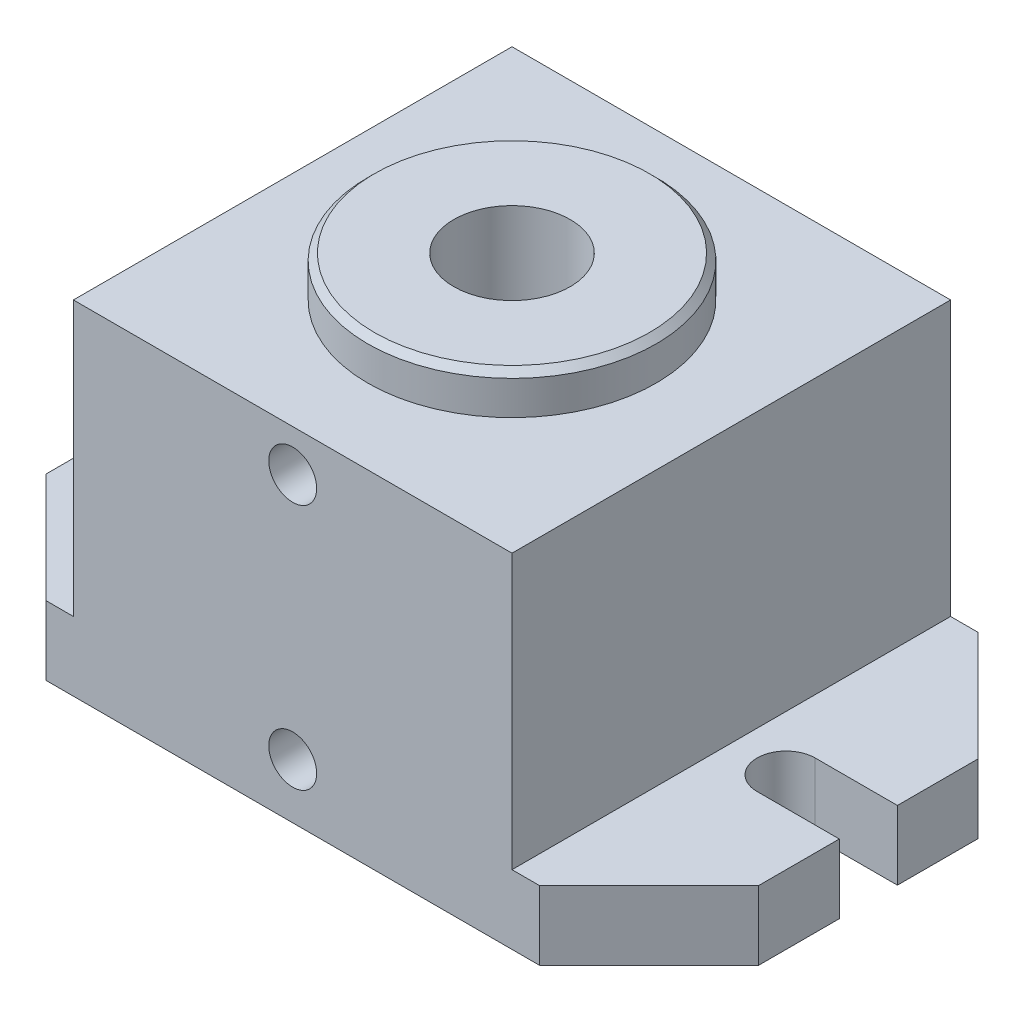
ISO-10303-21;
HEADER;
FILE_DESCRIPTION(('STEP AP214'),'2;1');
FILE_NAME('part.step','',(''),(''),'','','');
FILE_SCHEMA(('AUTOMOTIVE_DESIGN { 1 0 10303 214 1 1 1 1 }'));
ENDSEC;
DATA;
#1=APPLICATION_CONTEXT('core data for automotive mechanical design processes');
#2=APPLICATION_PROTOCOL_DEFINITION('international standard','automotive_design',2000,#1);
#3=PRODUCT_CONTEXT('',#1,'mechanical');
#4=PRODUCT('Part','Part','',(#3));
#5=PRODUCT_RELATED_PRODUCT_CATEGORY('part','',(#4));
#6=PRODUCT_DEFINITION_FORMATION('','',#4);
#7=PRODUCT_DEFINITION_CONTEXT('part definition',#1,'design');
#8=PRODUCT_DEFINITION('design','',#6,#7);
#9=PRODUCT_DEFINITION_SHAPE('','',#8);
#10=(LENGTH_UNIT() NAMED_UNIT(*) SI_UNIT(.MILLI.,.METRE.));
#11=(NAMED_UNIT(*) PLANE_ANGLE_UNIT() SI_UNIT($,.RADIAN.));
#12=(NAMED_UNIT(*) SI_UNIT($,.STERADIAN.) SOLID_ANGLE_UNIT());
#13=UNCERTAINTY_MEASURE_WITH_UNIT(LENGTH_MEASURE(1.E-05),#10,'distance_accuracy_value','');
#14=(GEOMETRIC_REPRESENTATION_CONTEXT(3) GLOBAL_UNCERTAINTY_ASSIGNED_CONTEXT((#13)) GLOBAL_UNIT_ASSIGNED_CONTEXT((#10,
#11,#12)) REPRESENTATION_CONTEXT('',''));
#15=CARTESIAN_POINT('',(0.,0.,0.));
#16=DIRECTION('',(0.,0.,1.));
#17=DIRECTION('',(1.,0.,0.));
#18=AXIS2_PLACEMENT_3D('',#15,#16,#17);
#19=CARTESIAN_POINT('',(-50.8,79.502,50.8));
#20=DIRECTION('',(0.,1.,0.));
#21=DIRECTION('',(0.,0.,1.));
#22=AXIS2_PLACEMENT_3D('',#19,#20,#21);
#23=PLANE('',#22);
#24=DIRECTION('',(0.,0.,1.));
#25=VECTOR('',#24,1.);
#26=CARTESIAN_POINT('',(-50.8,79.502,-50.8));
#27=LINE('',#26,#25);
#28=CARTESIAN_POINT('',(-50.8,79.502,-50.8));
#29=VERTEX_POINT('',#28);
#30=CARTESIAN_POINT('',(-50.8,79.502,50.8));
#31=VERTEX_POINT('',#30);
#32=EDGE_CURVE('E281',#29,#31,#27,.T.);
#33=ORIENTED_EDGE('',*,*,#32,.T.);
#34=DIRECTION('',(1.,0.,0.));
#35=VECTOR('',#34,1.);
#36=CARTESIAN_POINT('',(-50.8,79.502,50.8));
#37=LINE('',#36,#35);
#38=CARTESIAN_POINT('',(50.8,79.502,50.8));
#39=VERTEX_POINT('',#38);
#40=EDGE_CURVE('E289',#31,#39,#37,.T.);
#41=ORIENTED_EDGE('',*,*,#40,.T.);
#42=DIRECTION('',(0.,0.,-1.));
#43=VECTOR('',#42,1.);
#44=CARTESIAN_POINT('',(50.8,79.502,50.8));
#45=LINE('',#44,#43);
#46=CARTESIAN_POINT('',(50.8,79.502,-50.8));
#47=VERTEX_POINT('',#46);
#48=EDGE_CURVE('E287',#39,#47,#45,.T.);
#49=ORIENTED_EDGE('',*,*,#48,.T.);
#50=DIRECTION('',(-1.,0.,0.));
#51=VECTOR('',#50,1.);
#52=CARTESIAN_POINT('',(50.8,79.502,-50.8));
#53=LINE('',#52,#51);
#54=EDGE_CURVE('E285',#47,#29,#53,.T.);
#55=ORIENTED_EDGE('',*,*,#54,.T.);
#56=EDGE_LOOP('',(#33,#41,#49,#55));
#57=FACE_BOUND('',#56,.T.);
#58=CARTESIAN_POINT('',(0.,79.502,0.));
#59=DIRECTION('',(0.,1.,0.));
#60=DIRECTION('',(0.,0.,1.));
#61=AXIS2_PLACEMENT_3D('',#58,#59,#60);
#62=CIRCLE('',#61,33.401);
#63=CARTESIAN_POINT('',(0.,79.502,33.401));
#64=VERTEX_POINT('',#63);
#65=EDGE_CURVE('E284',#64,#64,#62,.T.);
#66=ORIENTED_EDGE('',*,*,#65,.F.);
#67=EDGE_LOOP('',(#66));
#68=FACE_BOUND('',#67,.T.);
#69=ADVANCED_FACE('F35',(#57,#68),#23,.T.);
#70=CARTESIAN_POINT('',(-50.8,79.502,-50.8));
#71=DIRECTION('',(1.,0.,0.));
#72=DIRECTION('',(0.,0.,-1.));
#73=AXIS2_PLACEMENT_3D('',#70,#71,#72);
#74=PLANE('',#73);
#75=DIRECTION('',(0.,-1.,0.));
#76=VECTOR('',#75,1.);
#77=CARTESIAN_POINT('',(-50.8,79.502,-50.8));
#78=LINE('',#77,#76);
#79=CARTESIAN_POINT('',(-50.8,16.002,-50.8));
#80=VERTEX_POINT('',#79);
#81=EDGE_CURVE('E219',#29,#80,#78,.T.);
#82=ORIENTED_EDGE('',*,*,#81,.T.);
#83=DIRECTION('',(0.,0.,1.));
#84=VECTOR('',#83,1.);
#85=CARTESIAN_POINT('',(-50.8,16.002,50.8));
#86=LINE('',#85,#84);
#87=CARTESIAN_POINT('',(-50.8,16.002,50.8));
#88=VERTEX_POINT('',#87);
#89=EDGE_CURVE('E214',#80,#88,#86,.T.);
#90=ORIENTED_EDGE('',*,*,#89,.T.);
#91=DIRECTION('',(0.,-1.,0.));
#92=VECTOR('',#91,1.);
#93=CARTESIAN_POINT('',(-50.8,79.502,50.8));
#94=LINE('',#93,#92);
#95=EDGE_CURVE('E256',#31,#88,#94,.T.);
#96=ORIENTED_EDGE('',*,*,#95,.F.);
#97=ORIENTED_EDGE('',*,*,#32,.F.);
#98=EDGE_LOOP('',(#82,#90,#96,#97));
#99=FACE_BOUND('',#98,.T.);
#100=ADVANCED_FACE('F432',(#99),#74,.F.);
#101=CARTESIAN_POINT('',(-50.8,79.502,50.8));
#102=DIRECTION('',(0.,0.,-1.));
#103=DIRECTION('',(-1.,0.,0.));
#104=AXIS2_PLACEMENT_3D('',#101,#102,#103);
#105=PLANE('',#104);
#106=CARTESIAN_POINT('',(0.,12.7,50.8));
#107=DIRECTION('',(0.,0.,1.));
#108=DIRECTION('',(1.,0.,0.));
#109=AXIS2_PLACEMENT_3D('',#106,#107,#108);
#110=CIRCLE('',#109,5.5499);
#111=CARTESIAN_POINT('',(5.5499,12.7,50.8));
#112=VERTEX_POINT('',#111);
#113=EDGE_CURVE('E750',#112,#112,#110,.T.);
#114=ORIENTED_EDGE('',*,*,#113,.F.);
#115=EDGE_LOOP('',(#114));
#116=FACE_BOUND('',#115,.T.);
#117=CARTESIAN_POINT('',(0.,69.85,50.8));
#118=DIRECTION('',(0.,0.,1.));
#119=DIRECTION('',(1.,0.,0.));
#120=AXIS2_PLACEMENT_3D('',#117,#118,#119);
#121=CIRCLE('',#120,5.5499);
#122=CARTESIAN_POINT('',(5.5499,69.85,50.8));
#123=VERTEX_POINT('',#122);
#124=EDGE_CURVE('E204',#123,#123,#121,.T.);
#125=ORIENTED_EDGE('',*,*,#124,.F.);
#126=EDGE_LOOP('',(#125));
#127=FACE_BOUND('',#126,.T.);
#128=DIRECTION('',(1.,0.,0.));
#129=VECTOR('',#128,1.);
#130=CARTESIAN_POINT('',(-50.8,0.,50.8));
#131=LINE('',#130,#129);
#132=CARTESIAN_POINT('',(-57.1499999999999,0.,50.8));
#133=VERTEX_POINT('',#132);
#134=CARTESIAN_POINT('',(57.1499999999999,0.,50.8));
#135=VERTEX_POINT('',#134);
#136=EDGE_CURVE('E282',#133,#135,#131,.T.);
#137=ORIENTED_EDGE('',*,*,#136,.T.);
#138=DIRECTION('',(0.,1.,0.));
#139=VECTOR('',#138,1.);
#140=CARTESIAN_POINT('',(57.1499999999999,16.002,50.8));
#141=LINE('',#140,#139);
#142=CARTESIAN_POINT('',(57.1499999999999,16.002,50.8));
#143=VERTEX_POINT('',#142);
#144=EDGE_CURVE('E43',#135,#143,#141,.T.);
#145=ORIENTED_EDGE('',*,*,#144,.T.);
#146=DIRECTION('',(-1.,0.,0.));
#147=VECTOR('',#146,1.);
#148=CARTESIAN_POINT('',(50.8,16.002,50.8));
#149=LINE('',#148,#147);
#150=CARTESIAN_POINT('',(50.8,16.002,50.8));
#151=VERTEX_POINT('',#150);
#152=EDGE_CURVE('E246',#143,#151,#149,.T.);
#153=ORIENTED_EDGE('',*,*,#152,.T.);
#154=DIRECTION('',(0.,-1.,0.));
#155=VECTOR('',#154,1.);
#156=CARTESIAN_POINT('',(50.8,79.502,50.8));
#157=LINE('',#156,#155);
#158=EDGE_CURVE('E260',#39,#151,#157,.T.);
#159=ORIENTED_EDGE('',*,*,#158,.F.);
#160=ORIENTED_EDGE('',*,*,#40,.F.);
#161=ORIENTED_EDGE('',*,*,#95,.T.);
#162=DIRECTION('',(-1.,0.,0.));
#163=VECTOR('',#162,1.);
#164=CARTESIAN_POINT('',(-50.8,16.002,50.8));
#165=LINE('',#164,#163);
#166=CARTESIAN_POINT('',(-57.1499999999999,16.002,50.8));
#167=VERTEX_POINT('',#166);
#168=EDGE_CURVE('E218',#88,#167,#165,.T.);
#169=ORIENTED_EDGE('',*,*,#168,.T.);
#170=DIRECTION('',(0.,-1.,0.));
#171=VECTOR('',#170,1.);
#172=CARTESIAN_POINT('',(-57.1499999999999,0.,50.8));
#173=LINE('',#172,#171);
#174=EDGE_CURVE('E394',#167,#133,#173,.T.);
#175=ORIENTED_EDGE('',*,*,#174,.T.);
#176=EDGE_LOOP('',(#137,#145,#153,#159,#160,#161,#169,#175));
#177=FACE_BOUND('',#176,.T.);
#178=ADVANCED_FACE('F421',(#116,#127,#177),#105,.F.);
#179=CARTESIAN_POINT('',(50.8,79.502,50.8));
#180=DIRECTION('',(-1.,0.,0.));
#181=DIRECTION('',(0.,0.,1.));
#182=AXIS2_PLACEMENT_3D('',#179,#180,#181);
#183=PLANE('',#182);
#184=ORIENTED_EDGE('',*,*,#158,.T.);
#185=DIRECTION('',(0.,0.,-1.));
#186=VECTOR('',#185,1.);
#187=CARTESIAN_POINT('',(50.8,16.002,50.8));
#188=LINE('',#187,#186);
#189=CARTESIAN_POINT('',(50.8,16.002,-50.8));
#190=VERTEX_POINT('',#189);
#191=EDGE_CURVE('E312',#151,#190,#188,.T.);
#192=ORIENTED_EDGE('',*,*,#191,.T.);
#193=DIRECTION('',(0.,-1.,0.));
#194=VECTOR('',#193,1.);
#195=CARTESIAN_POINT('',(50.8,79.502,-50.8));
#196=LINE('',#195,#194);
#197=EDGE_CURVE('E271',#47,#190,#196,.T.);
#198=ORIENTED_EDGE('',*,*,#197,.F.);
#199=ORIENTED_EDGE('',*,*,#48,.F.);
#200=EDGE_LOOP('',(#184,#192,#198,#199));
#201=FACE_BOUND('',#200,.T.);
#202=ADVANCED_FACE('F450',(#201),#183,.F.);
#203=CARTESIAN_POINT('',(50.8,79.502,-50.8));
#204=DIRECTION('',(0.,0.,1.));
#205=DIRECTION('',(1.,0.,0.));
#206=AXIS2_PLACEMENT_3D('',#203,#204,#205);
#207=PLANE('',#206);
#208=DIRECTION('',(-1.,0.,0.));
#209=VECTOR('',#208,1.);
#210=CARTESIAN_POINT('',(50.8,0.,-50.8));
#211=LINE('',#210,#209);
#212=CARTESIAN_POINT('',(57.1499999999999,0.,-50.8));
#213=VERTEX_POINT('',#212);
#214=CARTESIAN_POINT('',(-57.1499999999999,0.,-50.8));
#215=VERTEX_POINT('',#214);
#216=EDGE_CURVE('E278',#213,#215,#211,.T.);
#217=ORIENTED_EDGE('',*,*,#216,.T.);
#218=DIRECTION('',(0.,1.,0.));
#219=VECTOR('',#218,1.);
#220=CARTESIAN_POINT('',(-57.1499999999999,16.002,-50.8));
#221=LINE('',#220,#219);
#222=CARTESIAN_POINT('',(-57.1499999999999,16.002,-50.8));
#223=VERTEX_POINT('',#222);
#224=EDGE_CURVE('E238',#215,#223,#221,.T.);
#225=ORIENTED_EDGE('',*,*,#224,.T.);
#226=DIRECTION('',(1.,0.,0.));
#227=VECTOR('',#226,1.);
#228=CARTESIAN_POINT('',(-50.8,16.002,-50.8));
#229=LINE('',#228,#227);
#230=EDGE_CURVE('E208',#223,#80,#229,.T.);
#231=ORIENTED_EDGE('',*,*,#230,.T.);
#232=ORIENTED_EDGE('',*,*,#81,.F.);
#233=ORIENTED_EDGE('',*,*,#54,.F.);
#234=ORIENTED_EDGE('',*,*,#197,.T.);
#235=DIRECTION('',(1.,0.,0.));
#236=VECTOR('',#235,1.);
#237=CARTESIAN_POINT('',(50.8,16.002,-50.8));
#238=LINE('',#237,#236);
#239=CARTESIAN_POINT('',(57.1499999999999,16.002,-50.8));
#240=VERTEX_POINT('',#239);
#241=EDGE_CURVE('E336',#190,#240,#238,.T.);
#242=ORIENTED_EDGE('',*,*,#241,.T.);
#243=DIRECTION('',(0.,-1.,0.));
#244=VECTOR('',#243,1.);
#245=CARTESIAN_POINT('',(57.1499999999999,0.,-50.8));
#246=LINE('',#245,#244);
#247=EDGE_CURVE('E235',#240,#213,#246,.T.);
#248=ORIENTED_EDGE('',*,*,#247,.T.);
#249=EDGE_LOOP('',(#217,#225,#231,#232,#233,#234,#242,#248));
#250=FACE_BOUND('',#249,.T.);
#251=ADVANCED_FACE('F343',(#250),#207,.F.);
#252=CARTESIAN_POINT('',(-50.8,0.,50.8));
#253=DIRECTION('',(0.,1.,0.));
#254=DIRECTION('',(0.,0.,1.));
#255=AXIS2_PLACEMENT_3D('',#252,#253,#254);
#256=PLANE('',#255);
#257=CARTESIAN_POINT('',(0.,0.,0.));
#258=DIRECTION('',(0.,1.,0.));
#259=DIRECTION('',(0.,0.,1.));
#260=AXIS2_PLACEMENT_3D('',#257,#258,#259);
#261=CIRCLE('',#260,13.4874);
#262=CARTESIAN_POINT('',(0.,0.,13.4874));
#263=VERTEX_POINT('',#262);
#264=EDGE_CURVE('E295',#263,#263,#261,.T.);
#265=ORIENTED_EDGE('',*,*,#264,.T.);
#266=EDGE_LOOP('',(#265));
#267=FACE_BOUND('',#266,.T.);
#268=DIRECTION('',(0.,0.,-1.));
#269=VECTOR('',#268,1.);
#270=CARTESIAN_POINT('',(-82.55,0.,-6.73099999999998));
#271=LINE('',#270,#269);
#272=CARTESIAN_POINT('',(-82.55,0.,-6.73099999999998));
#273=VERTEX_POINT('',#272);
#274=CARTESIAN_POINT('',(-82.55,0.,-25.3999999999999));
#275=VERTEX_POINT('',#274);
#276=EDGE_CURVE('E367',#273,#275,#271,.T.);
#277=ORIENTED_EDGE('',*,*,#276,.T.);
#278=DIRECTION('',(0.707106781186548,0.,-0.707106781186548));
#279=VECTOR('',#278,1.);
#280=CARTESIAN_POINT('',(-82.55,0.,-25.3999999999999));
#281=LINE('',#280,#279);
#282=EDGE_CURVE('E233',#275,#215,#281,.T.);
#283=ORIENTED_EDGE('',*,*,#282,.T.);
#284=ORIENTED_EDGE('',*,*,#216,.F.);
#285=DIRECTION('',(0.707106781186548,0.,0.707106781186548));
#286=VECTOR('',#285,1.);
#287=CARTESIAN_POINT('',(57.1499999999999,0.,-50.8));
#288=LINE('',#287,#286);
#289=CARTESIAN_POINT('',(82.55,0.,-25.3999999999999));
#290=VERTEX_POINT('',#289);
#291=EDGE_CURVE('E353',#213,#290,#288,.T.);
#292=ORIENTED_EDGE('',*,*,#291,.T.);
#293=DIRECTION('',(0.,0.,1.));
#294=VECTOR('',#293,1.);
#295=CARTESIAN_POINT('',(82.55,0.,-6.731));
#296=LINE('',#295,#294);
#297=CARTESIAN_POINT('',(82.55,0.,-6.731));
#298=VERTEX_POINT('',#297);
#299=EDGE_CURVE('E322',#290,#298,#296,.T.);
#300=ORIENTED_EDGE('',*,*,#299,.T.);
#301=DIRECTION('',(-1.,0.,0.));
#302=VECTOR('',#301,1.);
#303=CARTESIAN_POINT('',(63.5,0.,-6.731));
#304=LINE('',#303,#302);
#305=CARTESIAN_POINT('',(63.5,0.,-6.731));
#306=VERTEX_POINT('',#305);
#307=EDGE_CURVE('E319',#298,#306,#304,.T.);
#308=ORIENTED_EDGE('',*,*,#307,.T.);
#309=CARTESIAN_POINT('',(63.5,0.,0.));
#310=DIRECTION('',(0.,1.,0.));
#311=DIRECTION('',(0.,0.,-1.));
#312=AXIS2_PLACEMENT_3D('',#309,#310,#311);
#313=CIRCLE('',#312,6.731);
#314=CARTESIAN_POINT('',(63.5,0.,6.731));
#315=VERTEX_POINT('',#314);
#316=EDGE_CURVE('E316',#306,#315,#313,.T.);
#317=ORIENTED_EDGE('',*,*,#316,.T.);
#318=DIRECTION('',(1.,0.,0.));
#319=VECTOR('',#318,1.);
#320=CARTESIAN_POINT('',(63.5,0.,6.731));
#321=LINE('',#320,#319);
#322=CARTESIAN_POINT('',(82.55,0.,6.731));
#323=VERTEX_POINT('',#322);
#324=EDGE_CURVE('E313',#315,#323,#321,.T.);
#325=ORIENTED_EDGE('',*,*,#324,.T.);
#326=DIRECTION('',(0.,0.,1.));
#327=VECTOR('',#326,1.);
#328=CARTESIAN_POINT('',(82.55,0.,50.8));
#329=LINE('',#328,#327);
#330=CARTESIAN_POINT('',(82.55,0.,25.3999999999999));
#331=VERTEX_POINT('',#330);
#332=EDGE_CURVE('E309',#323,#331,#329,.T.);
#333=ORIENTED_EDGE('',*,*,#332,.T.);
#334=DIRECTION('',(-0.707106781186548,0.,0.707106781186548));
#335=VECTOR('',#334,1.);
#336=CARTESIAN_POINT('',(82.55,0.,25.3999999999999));
#337=LINE('',#336,#335);
#338=EDGE_CURVE('E356',#331,#135,#337,.T.);
#339=ORIENTED_EDGE('',*,*,#338,.T.);
#340=ORIENTED_EDGE('',*,*,#136,.F.);
#341=DIRECTION('',(-0.707106781186548,0.,-0.707106781186547));
#342=VECTOR('',#341,1.);
#343=CARTESIAN_POINT('',(-57.1499999999999,0.,50.8));
#344=LINE('',#343,#342);
#345=CARTESIAN_POINT('',(-82.55,0.,25.3999999999999));
#346=VERTEX_POINT('',#345);
#347=EDGE_CURVE('E357',#133,#346,#344,.T.);
#348=ORIENTED_EDGE('',*,*,#347,.T.);
#349=DIRECTION('',(0.,0.,-1.));
#350=VECTOR('',#349,1.);
#351=CARTESIAN_POINT('',(-82.55,0.,50.8));
#352=LINE('',#351,#350);
#353=CARTESIAN_POINT('',(-82.55,0.,6.73099999999998));
#354=VERTEX_POINT('',#353);
#355=EDGE_CURVE('E201',#346,#354,#352,.T.);
#356=ORIENTED_EDGE('',*,*,#355,.T.);
#357=DIRECTION('',(1.,0.,0.));
#358=VECTOR('',#357,1.);
#359=CARTESIAN_POINT('',(-63.5,0.,6.73099999999999));
#360=LINE('',#359,#358);
#361=CARTESIAN_POINT('',(-63.5,0.,6.73099999999999));
#362=VERTEX_POINT('',#361);
#363=EDGE_CURVE('E198',#354,#362,#360,.T.);
#364=ORIENTED_EDGE('',*,*,#363,.T.);
#365=CARTESIAN_POINT('',(-63.5,0.,0.));
#366=DIRECTION('',(0.,1.,0.));
#367=DIRECTION('',(0.,0.,1.));
#368=AXIS2_PLACEMENT_3D('',#365,#366,#367);
#369=CIRCLE('',#368,6.73099999999999);
#370=CARTESIAN_POINT('',(-63.5,0.,-6.73099999999999));
#371=VERTEX_POINT('',#370);
#372=EDGE_CURVE('E373',#362,#371,#369,.T.);
#373=ORIENTED_EDGE('',*,*,#372,.T.);
#374=DIRECTION('',(-1.,0.,0.));
#375=VECTOR('',#374,1.);
#376=CARTESIAN_POINT('',(-63.5,0.,-6.73099999999999));
#377=LINE('',#376,#375);
#378=EDGE_CURVE('E177',#371,#273,#377,.T.);
#379=ORIENTED_EDGE('',*,*,#378,.T.);
#380=EDGE_LOOP('',(#277,#283,#284,#292,#300,#308,#317,#325,#333,#339,#340,#348,#356,#364,#373,#379));
#381=FACE_BOUND('',#380,.T.);
#382=ADVANCED_FACE('F370',(#267,#381),#256,.F.);
#383=CARTESIAN_POINT('',(0.,88.9,0.));
#384=DIRECTION('',(0.,-1.,0.));
#385=DIRECTION('',(0.,0.,-1.));
#386=AXIS2_PLACEMENT_3D('',#383,#384,#385);
#387=CYLINDRICAL_SURFACE('',#386,33.401);
#388=CARTESIAN_POINT('',(0.,87.376,0.));
#389=DIRECTION('',(0.,1.,0.));
#390=DIRECTION('',(0.,0.,1.));
#391=AXIS2_PLACEMENT_3D('',#388,#389,#390);
#392=CIRCLE('',#391,33.401);
#393=CARTESIAN_POINT('',(0.,87.376,33.401));
#394=VERTEX_POINT('',#393);
#395=EDGE_CURVE('E268',#394,#394,#392,.F.);
#396=ORIENTED_EDGE('',*,*,#395,.T.);
#397=EDGE_LOOP('',(#396));
#398=FACE_BOUND('',#397,.T.);
#399=ORIENTED_EDGE('',*,*,#65,.T.);
#400=EDGE_LOOP('',(#399));
#401=FACE_BOUND('',#400,.T.);
#402=ADVANCED_FACE('F443',(#398,#401),#387,.T.);
#403=CARTESIAN_POINT('',(0.,88.9,0.));
#404=DIRECTION('',(0.,1.,0.));
#405=DIRECTION('',(0.,0.,1.));
#406=AXIS2_PLACEMENT_3D('',#403,#404,#405);
#407=PLANE('',#406);
#408=CARTESIAN_POINT('',(0.,88.9,0.));
#409=DIRECTION('',(0.,1.,0.));
#410=DIRECTION('',(0.,0.,1.));
#411=AXIS2_PLACEMENT_3D('',#408,#409,#410);
#412=CIRCLE('',#411,13.4874);
#413=CARTESIAN_POINT('',(0.,88.9,13.4874));
#414=VERTEX_POINT('',#413);
#415=EDGE_CURVE('E296',#414,#414,#412,.T.);
#416=ORIENTED_EDGE('',*,*,#415,.F.);
#417=EDGE_LOOP('',(#416));
#418=FACE_BOUND('',#417,.T.);
#419=CARTESIAN_POINT('',(0.,88.9,0.));
#420=DIRECTION('',(0.,1.,0.));
#421=DIRECTION('',(0.,0.,1.));
#422=AXIS2_PLACEMENT_3D('',#419,#420,#421);
#423=CIRCLE('',#422,31.877);
#424=CARTESIAN_POINT('',(0.,88.9,31.877));
#425=VERTEX_POINT('',#424);
#426=EDGE_CURVE('E259',#425,#425,#423,.T.);
#427=ORIENTED_EDGE('',*,*,#426,.T.);
#428=EDGE_LOOP('',(#427));
#429=FACE_BOUND('',#428,.T.);
#430=ADVANCED_FACE('F461',(#418,#429),#407,.T.);
#431=CARTESIAN_POINT('',(0.,88.9,0.));
#432=DIRECTION('',(0.,-1.,0.));
#433=DIRECTION('',(0.,0.,-1.));
#434=AXIS2_PLACEMENT_3D('',#431,#432,#433);
#435=CONICAL_SURFACE('',#434,31.877,0.785398163397453);
#436=ORIENTED_EDGE('',*,*,#395,.F.);
#437=EDGE_LOOP('',(#436));
#438=FACE_BOUND('',#437,.T.);
#439=ORIENTED_EDGE('',*,*,#426,.F.);
#440=EDGE_LOOP('',(#439));
#441=FACE_BOUND('',#440,.T.);
#442=ADVANCED_FACE('F457',(#438,#441),#435,.T.);
#443=CARTESIAN_POINT('',(0.,0.,0.));
#444=DIRECTION('',(0.,1.,0.));
#445=DIRECTION('',(0.,0.,1.));
#446=AXIS2_PLACEMENT_3D('',#443,#444,#445);
#447=CYLINDRICAL_SURFACE('',#446,13.4874);
#448=ORIENTED_EDGE('',*,*,#264,.F.);
#449=EDGE_LOOP('',(#448));
#450=FACE_BOUND('',#449,.T.);
#451=ORIENTED_EDGE('',*,*,#415,.T.);
#452=EDGE_LOOP('',(#451));
#453=FACE_BOUND('',#452,.T.);
#454=ADVANCED_FACE('F460',(#450,#453),#447,.F.);
#455=CARTESIAN_POINT('',(82.55,16.002,50.8));
#456=DIRECTION('',(1.,0.,0.));
#457=DIRECTION('',(0.,0.,-1.));
#458=AXIS2_PLACEMENT_3D('',#455,#456,#457);
#459=PLANE('',#458);
#460=DIRECTION('',(0.,0.,1.));
#461=VECTOR('',#460,1.);
#462=CARTESIAN_POINT('',(82.55,16.002,50.8));
#463=LINE('',#462,#461);
#464=CARTESIAN_POINT('',(82.55,16.002,6.731));
#465=VERTEX_POINT('',#464);
#466=CARTESIAN_POINT('',(82.55,16.002,25.3999999999999));
#467=VERTEX_POINT('',#466);
#468=EDGE_CURVE('E250',#465,#467,#463,.T.);
#469=ORIENTED_EDGE('',*,*,#468,.T.);
#470=DIRECTION('',(0.,-1.,0.));
#471=VECTOR('',#470,1.);
#472=CARTESIAN_POINT('',(82.55,0.,25.3999999999999));
#473=LINE('',#472,#471);
#474=EDGE_CURVE('E395',#467,#331,#473,.T.);
#475=ORIENTED_EDGE('',*,*,#474,.T.);
#476=ORIENTED_EDGE('',*,*,#332,.F.);
#477=DIRECTION('',(0.,-1.,0.));
#478=VECTOR('',#477,1.);
#479=CARTESIAN_POINT('',(82.55,16.002,6.731));
#480=LINE('',#479,#478);
#481=EDGE_CURVE('E299',#465,#323,#480,.T.);
#482=ORIENTED_EDGE('',*,*,#481,.F.);
#483=EDGE_LOOP('',(#469,#475,#476,#482));
#484=FACE_BOUND('',#483,.T.);
#485=ADVANCED_FACE('F418',(#484),#459,.T.);
#486=CARTESIAN_POINT('',(63.5,16.002,6.731));
#487=DIRECTION('',(0.,0.,-1.));
#488=DIRECTION('',(-1.,0.,0.));
#489=AXIS2_PLACEMENT_3D('',#486,#487,#488);
#490=PLANE('',#489);
#491=ORIENTED_EDGE('',*,*,#324,.F.);
#492=DIRECTION('',(0.,-1.,0.));
#493=VECTOR('',#492,1.);
#494=CARTESIAN_POINT('',(63.5,16.002,6.731));
#495=LINE('',#494,#493);
#496=CARTESIAN_POINT('',(63.5,16.002,6.731));
#497=VERTEX_POINT('',#496);
#498=EDGE_CURVE('E306',#497,#315,#495,.T.);
#499=ORIENTED_EDGE('',*,*,#498,.F.);
#500=DIRECTION('',(1.,0.,0.));
#501=VECTOR('',#500,1.);
#502=CARTESIAN_POINT('',(63.5,16.002,6.731));
#503=LINE('',#502,#501);
#504=EDGE_CURVE('E325',#497,#465,#503,.T.);
#505=ORIENTED_EDGE('',*,*,#504,.T.);
#506=ORIENTED_EDGE('',*,*,#481,.T.);
#507=EDGE_LOOP('',(#491,#499,#505,#506));
#508=FACE_BOUND('',#507,.T.);
#509=ADVANCED_FACE('F415',(#508),#490,.T.);
#510=CARTESIAN_POINT('',(63.5,16.002,0.));
#511=DIRECTION('',(0.,-1.,0.));
#512=DIRECTION('',(0.,0.,-1.));
#513=AXIS2_PLACEMENT_3D('',#510,#511,#512);
#514=CYLINDRICAL_SURFACE('',#513,6.731);
#515=ORIENTED_EDGE('',*,*,#316,.F.);
#516=DIRECTION('',(0.,-1.,0.));
#517=VECTOR('',#516,1.);
#518=CARTESIAN_POINT('',(63.5,16.002,-6.731));
#519=LINE('',#518,#517);
#520=CARTESIAN_POINT('',(63.5,16.002,-6.731));
#521=VERTEX_POINT('',#520);
#522=EDGE_CURVE('E304',#521,#306,#519,.T.);
#523=ORIENTED_EDGE('',*,*,#522,.F.);
#524=CARTESIAN_POINT('',(63.5,16.002,0.));
#525=DIRECTION('',(0.,1.,0.));
#526=DIRECTION('',(0.,0.,-1.));
#527=AXIS2_PLACEMENT_3D('',#524,#525,#526);
#528=CIRCLE('',#527,6.731);
#529=EDGE_CURVE('E328',#521,#497,#528,.T.);
#530=ORIENTED_EDGE('',*,*,#529,.T.);
#531=ORIENTED_EDGE('',*,*,#498,.T.);
#532=EDGE_LOOP('',(#515,#523,#530,#531));
#533=FACE_BOUND('',#532,.T.);
#534=ADVANCED_FACE('F412',(#533),#514,.F.);
#535=CARTESIAN_POINT('',(63.5,16.002,-6.731));
#536=DIRECTION('',(0.,0.,1.));
#537=DIRECTION('',(1.,0.,0.));
#538=AXIS2_PLACEMENT_3D('',#535,#536,#537);
#539=PLANE('',#538);
#540=ORIENTED_EDGE('',*,*,#307,.F.);
#541=DIRECTION('',(0.,-1.,0.));
#542=VECTOR('',#541,1.);
#543=CARTESIAN_POINT('',(82.55,16.002,-6.731));
#544=LINE('',#543,#542);
#545=CARTESIAN_POINT('',(82.55,16.002,-6.731));
#546=VERTEX_POINT('',#545);
#547=EDGE_CURVE('E249',#546,#298,#544,.T.);
#548=ORIENTED_EDGE('',*,*,#547,.F.);
#549=DIRECTION('',(-1.,0.,0.));
#550=VECTOR('',#549,1.);
#551=CARTESIAN_POINT('',(63.5,16.002,-6.731));
#552=LINE('',#551,#550);
#553=EDGE_CURVE('E331',#546,#521,#552,.T.);
#554=ORIENTED_EDGE('',*,*,#553,.T.);
#555=ORIENTED_EDGE('',*,*,#522,.T.);
#556=EDGE_LOOP('',(#540,#548,#554,#555));
#557=FACE_BOUND('',#556,.T.);
#558=ADVANCED_FACE('F408',(#557),#539,.T.);
#559=CARTESIAN_POINT('',(82.55,16.002,-6.731));
#560=DIRECTION('',(1.,0.,0.));
#561=DIRECTION('',(0.,0.,-1.));
#562=AXIS2_PLACEMENT_3D('',#559,#560,#561);
#563=PLANE('',#562);
#564=ORIENTED_EDGE('',*,*,#299,.F.);
#565=DIRECTION('',(0.,1.,0.));
#566=VECTOR('',#565,1.);
#567=CARTESIAN_POINT('',(82.55,16.002,-25.3999999999999));
#568=LINE('',#567,#566);
#569=CARTESIAN_POINT('',(82.55,16.002,-25.3999999999999));
#570=VERTEX_POINT('',#569);
#571=EDGE_CURVE('E244',#290,#570,#568,.T.);
#572=ORIENTED_EDGE('',*,*,#571,.T.);
#573=DIRECTION('',(0.,0.,1.));
#574=VECTOR('',#573,1.);
#575=CARTESIAN_POINT('',(82.55,16.002,-6.731));
#576=LINE('',#575,#574);
#577=EDGE_CURVE('E334',#570,#546,#576,.T.);
#578=ORIENTED_EDGE('',*,*,#577,.T.);
#579=ORIENTED_EDGE('',*,*,#547,.T.);
#580=EDGE_LOOP('',(#564,#572,#578,#579));
#581=FACE_BOUND('',#580,.T.);
#582=ADVANCED_FACE('F405',(#581),#563,.T.);
#583=CARTESIAN_POINT('',(63.5,16.002,0.));
#584=DIRECTION('',(0.,-1.,0.));
#585=DIRECTION('',(0.,0.,-1.));
#586=AXIS2_PLACEMENT_3D('',#583,#584,#585);
#587=PLANE('',#586);
#588=ORIENTED_EDGE('',*,*,#577,.F.);
#589=DIRECTION('',(-0.707106781186548,0.,-0.707106781186548));
#590=VECTOR('',#589,1.);
#591=CARTESIAN_POINT('',(57.1499999999999,16.002,-50.8));
#592=LINE('',#591,#590);
#593=EDGE_CURVE('E352',#570,#240,#592,.T.);
#594=ORIENTED_EDGE('',*,*,#593,.T.);
#595=ORIENTED_EDGE('',*,*,#241,.F.);
#596=ORIENTED_EDGE('',*,*,#191,.F.);
#597=ORIENTED_EDGE('',*,*,#152,.F.);
#598=DIRECTION('',(0.707106781186548,0.,-0.707106781186548));
#599=VECTOR('',#598,1.);
#600=CARTESIAN_POINT('',(82.55,16.002,25.3999999999999));
#601=LINE('',#600,#599);
#602=EDGE_CURVE('E50',#143,#467,#601,.T.);
#603=ORIENTED_EDGE('',*,*,#602,.T.);
#604=ORIENTED_EDGE('',*,*,#468,.F.);
#605=ORIENTED_EDGE('',*,*,#504,.F.);
#606=ORIENTED_EDGE('',*,*,#529,.F.);
#607=ORIENTED_EDGE('',*,*,#553,.F.);
#608=EDGE_LOOP('',(#588,#594,#595,#596,#597,#603,#604,#605,#606,#607));
#609=FACE_BOUND('',#608,.T.);
#610=ADVANCED_FACE('F400',(#609),#587,.F.);
#611=CARTESIAN_POINT('',(-63.5,16.002,0.));
#612=DIRECTION('',(0.,-1.,0.));
#613=DIRECTION('',(0.,0.,-1.));
#614=AXIS2_PLACEMENT_3D('',#611,#612,#613);
#615=CYLINDRICAL_SURFACE('',#614,6.73099999999999);
#616=ORIENTED_EDGE('',*,*,#372,.F.);
#617=DIRECTION('',(0.,-1.,0.));
#618=VECTOR('',#617,1.);
#619=CARTESIAN_POINT('',(-63.5,16.002,6.73099999999999));
#620=LINE('',#619,#618);
#621=CARTESIAN_POINT('',(-63.5,16.002,6.73099999999999));
#622=VERTEX_POINT('',#621);
#623=EDGE_CURVE('E197',#622,#362,#620,.T.);
#624=ORIENTED_EDGE('',*,*,#623,.F.);
#625=CARTESIAN_POINT('',(-63.5,16.002,0.));
#626=DIRECTION('',(0.,1.,0.));
#627=DIRECTION('',(0.,0.,1.));
#628=AXIS2_PLACEMENT_3D('',#625,#626,#627);
#629=CIRCLE('',#628,6.73099999999999);
#630=CARTESIAN_POINT('',(-63.5,16.002,-6.73099999999999));
#631=VERTEX_POINT('',#630);
#632=EDGE_CURVE('E191',#622,#631,#629,.T.);
#633=ORIENTED_EDGE('',*,*,#632,.T.);
#634=DIRECTION('',(0.,-1.,0.));
#635=VECTOR('',#634,1.);
#636=CARTESIAN_POINT('',(-63.5,16.002,-6.73099999999999));
#637=LINE('',#636,#635);
#638=EDGE_CURVE('E172',#631,#371,#637,.T.);
#639=ORIENTED_EDGE('',*,*,#638,.T.);
#640=EDGE_LOOP('',(#616,#624,#633,#639));
#641=FACE_BOUND('',#640,.T.);
#642=ADVANCED_FACE('F196',(#641),#615,.F.);
#643=CARTESIAN_POINT('',(-63.5,16.002,6.73099999999999));
#644=DIRECTION('',(0.,0.,-1.));
#645=DIRECTION('',(-1.,0.,0.));
#646=AXIS2_PLACEMENT_3D('',#643,#644,#645);
#647=PLANE('',#646);
#648=ORIENTED_EDGE('',*,*,#363,.F.);
#649=DIRECTION('',(0.,-1.,0.));
#650=VECTOR('',#649,1.);
#651=CARTESIAN_POINT('',(-82.55,16.002,6.73099999999998));
#652=LINE('',#651,#650);
#653=CARTESIAN_POINT('',(-82.55,16.002,6.73099999999998));
#654=VERTEX_POINT('',#653);
#655=EDGE_CURVE('E378',#654,#354,#652,.T.);
#656=ORIENTED_EDGE('',*,*,#655,.F.);
#657=DIRECTION('',(1.,0.,0.));
#658=VECTOR('',#657,1.);
#659=CARTESIAN_POINT('',(-63.5,16.002,6.73099999999999));
#660=LINE('',#659,#658);
#661=EDGE_CURVE('E183',#654,#622,#660,.T.);
#662=ORIENTED_EDGE('',*,*,#661,.T.);
#663=ORIENTED_EDGE('',*,*,#623,.T.);
#664=EDGE_LOOP('',(#648,#656,#662,#663));
#665=FACE_BOUND('',#664,.T.);
#666=ADVANCED_FACE('F387',(#665),#647,.T.);
#667=CARTESIAN_POINT('',(-82.55,16.002,50.8));
#668=DIRECTION('',(-1.,0.,0.));
#669=DIRECTION('',(0.,0.,1.));
#670=AXIS2_PLACEMENT_3D('',#667,#668,#669);
#671=PLANE('',#670);
#672=ORIENTED_EDGE('',*,*,#355,.F.);
#673=DIRECTION('',(0.,1.,0.));
#674=VECTOR('',#673,1.);
#675=CARTESIAN_POINT('',(-82.55,16.002,25.3999999999999));
#676=LINE('',#675,#674);
#677=CARTESIAN_POINT('',(-82.55,16.002,25.3999999999999));
#678=VERTEX_POINT('',#677);
#679=EDGE_CURVE('E11',#346,#678,#676,.T.);
#680=ORIENTED_EDGE('',*,*,#679,.T.);
#681=DIRECTION('',(0.,0.,-1.));
#682=VECTOR('',#681,1.);
#683=CARTESIAN_POINT('',(-82.55,16.002,50.8));
#684=LINE('',#683,#682);
#685=EDGE_CURVE('E211',#678,#654,#684,.T.);
#686=ORIENTED_EDGE('',*,*,#685,.T.);
#687=ORIENTED_EDGE('',*,*,#655,.T.);
#688=EDGE_LOOP('',(#672,#680,#686,#687));
#689=FACE_BOUND('',#688,.T.);
#690=ADVANCED_FACE('F383',(#689),#671,.T.);
#691=CARTESIAN_POINT('',(-82.55,16.002,-6.73099999999998));
#692=DIRECTION('',(-1.,0.,0.));
#693=DIRECTION('',(0.,0.,1.));
#694=AXIS2_PLACEMENT_3D('',#691,#692,#693);
#695=PLANE('',#694);
#696=DIRECTION('',(0.,0.,-1.));
#697=VECTOR('',#696,1.);
#698=CARTESIAN_POINT('',(-82.55,16.002,-6.73099999999998));
#699=LINE('',#698,#697);
#700=CARTESIAN_POINT('',(-82.55,16.002,-6.73099999999998));
#701=VERTEX_POINT('',#700);
#702=CARTESIAN_POINT('',(-82.55,16.002,-25.3999999999999));
#703=VERTEX_POINT('',#702);
#704=EDGE_CURVE('E194',#701,#703,#699,.T.);
#705=ORIENTED_EDGE('',*,*,#704,.T.);
#706=DIRECTION('',(0.,-1.,0.));
#707=VECTOR('',#706,1.);
#708=CARTESIAN_POINT('',(-82.55,0.,-25.3999999999999));
#709=LINE('',#708,#707);
#710=EDGE_CURVE('E228',#703,#275,#709,.T.);
#711=ORIENTED_EDGE('',*,*,#710,.T.);
#712=ORIENTED_EDGE('',*,*,#276,.F.);
#713=DIRECTION('',(0.,-1.,0.));
#714=VECTOR('',#713,1.);
#715=CARTESIAN_POINT('',(-82.55,16.002,-6.73099999999998));
#716=LINE('',#715,#714);
#717=EDGE_CURVE('E182',#701,#273,#716,.T.);
#718=ORIENTED_EDGE('',*,*,#717,.F.);
#719=EDGE_LOOP('',(#705,#711,#712,#718));
#720=FACE_BOUND('',#719,.T.);
#721=ADVANCED_FACE('F366',(#720),#695,.T.);
#722=CARTESIAN_POINT('',(-63.5,16.002,-6.73099999999999));
#723=DIRECTION('',(0.,0.,1.));
#724=DIRECTION('',(1.,0.,0.));
#725=AXIS2_PLACEMENT_3D('',#722,#723,#724);
#726=PLANE('',#725);
#727=ORIENTED_EDGE('',*,*,#378,.F.);
#728=ORIENTED_EDGE('',*,*,#638,.F.);
#729=DIRECTION('',(-1.,0.,0.));
#730=VECTOR('',#729,1.);
#731=CARTESIAN_POINT('',(-63.5,16.002,-6.73099999999999));
#732=LINE('',#731,#730);
#733=EDGE_CURVE('E175',#631,#701,#732,.T.);
#734=ORIENTED_EDGE('',*,*,#733,.T.);
#735=ORIENTED_EDGE('',*,*,#717,.T.);
#736=EDGE_LOOP('',(#727,#728,#734,#735));
#737=FACE_BOUND('',#736,.T.);
#738=ADVANCED_FACE('F174',(#737),#726,.T.);
#739=CARTESIAN_POINT('',(-63.5,16.002,0.));
#740=DIRECTION('',(0.,1.,0.));
#741=DIRECTION('',(0.,0.,1.));
#742=AXIS2_PLACEMENT_3D('',#739,#740,#741);
#743=PLANE('',#742);
#744=ORIENTED_EDGE('',*,*,#230,.F.);
#745=DIRECTION('',(-0.707106781186548,0.,0.707106781186548));
#746=VECTOR('',#745,1.);
#747=CARTESIAN_POINT('',(-85.7249999999999,16.002,-22.2249999999999));
#748=LINE('',#747,#746);
#749=EDGE_CURVE('E242',#223,#703,#748,.T.);
#750=ORIENTED_EDGE('',*,*,#749,.T.);
#751=ORIENTED_EDGE('',*,*,#704,.F.);
#752=ORIENTED_EDGE('',*,*,#733,.F.);
#753=ORIENTED_EDGE('',*,*,#632,.F.);
#754=ORIENTED_EDGE('',*,*,#661,.F.);
#755=ORIENTED_EDGE('',*,*,#685,.F.);
#756=DIRECTION('',(0.707106781186548,0.,0.707106781186547));
#757=VECTOR('',#756,1.);
#758=CARTESIAN_POINT('',(-85.725,16.002,22.225));
#759=LINE('',#758,#757);
#760=EDGE_CURVE('E240',#678,#167,#759,.T.);
#761=ORIENTED_EDGE('',*,*,#760,.T.);
#762=ORIENTED_EDGE('',*,*,#168,.F.);
#763=ORIENTED_EDGE('',*,*,#89,.F.);
#764=EDGE_LOOP('',(#744,#750,#751,#752,#753,#754,#755,#761,#762,#763));
#765=FACE_BOUND('',#764,.T.);
#766=ADVANCED_FACE('F189',(#765),#743,.T.);
#767=CARTESIAN_POINT('',(-82.55,16.002,-25.3999999999999));
#768=DIRECTION('',(-0.707106781186548,0.,-0.707106781186548));
#769=DIRECTION('',(-0.707106781186548,0.,0.707106781186548));
#770=AXIS2_PLACEMENT_3D('',#767,#768,#769);
#771=PLANE('',#770);
#772=ORIENTED_EDGE('',*,*,#749,.F.);
#773=ORIENTED_EDGE('',*,*,#224,.F.);
#774=ORIENTED_EDGE('',*,*,#282,.F.);
#775=ORIENTED_EDGE('',*,*,#710,.F.);
#776=EDGE_LOOP('',(#772,#773,#774,#775));
#777=FACE_BOUND('',#776,.T.);
#778=ADVANCED_FACE('F429',(#777),#771,.T.);
#779=CARTESIAN_POINT('',(57.1499999999999,79.502,-50.8));
#780=DIRECTION('',(0.707106781186548,0.,-0.707106781186548));
#781=DIRECTION('',(-0.707106781186548,0.,-0.707106781186548));
#782=AXIS2_PLACEMENT_3D('',#779,#780,#781);
#783=PLANE('',#782);
#784=ORIENTED_EDGE('',*,*,#593,.F.);
#785=ORIENTED_EDGE('',*,*,#571,.F.);
#786=ORIENTED_EDGE('',*,*,#291,.F.);
#787=ORIENTED_EDGE('',*,*,#247,.F.);
#788=EDGE_LOOP('',(#784,#785,#786,#787));
#789=FACE_BOUND('',#788,.T.);
#790=ADVANCED_FACE('F350',(#789),#783,.T.);
#791=CARTESIAN_POINT('',(82.55,16.002,25.3999999999999));
#792=DIRECTION('',(0.707106781186548,0.,0.707106781186548));
#793=DIRECTION('',(0.707106781186548,0.,-0.707106781186548));
#794=AXIS2_PLACEMENT_3D('',#791,#792,#793);
#795=PLANE('',#794);
#796=ORIENTED_EDGE('',*,*,#602,.F.);
#797=ORIENTED_EDGE('',*,*,#144,.F.);
#798=ORIENTED_EDGE('',*,*,#338,.F.);
#799=ORIENTED_EDGE('',*,*,#474,.F.);
#800=EDGE_LOOP('',(#796,#797,#798,#799));
#801=FACE_BOUND('',#800,.T.);
#802=ADVANCED_FACE('F422',(#801),#795,.T.);
#803=CARTESIAN_POINT('',(-57.1499999999999,79.502,50.8));
#804=DIRECTION('',(-0.707106781186547,0.,0.707106781186548));
#805=DIRECTION('',(0.707106781186548,0.,0.707106781186547));
#806=AXIS2_PLACEMENT_3D('',#803,#804,#805);
#807=PLANE('',#806);
#808=ORIENTED_EDGE('',*,*,#760,.F.);
#809=ORIENTED_EDGE('',*,*,#679,.F.);
#810=ORIENTED_EDGE('',*,*,#347,.F.);
#811=ORIENTED_EDGE('',*,*,#174,.F.);
#812=EDGE_LOOP('',(#808,#809,#810,#811));
#813=FACE_BOUND('',#812,.T.);
#814=ADVANCED_FACE('F37',(#813),#807,.T.);
#815=CARTESIAN_POINT('',(0.,69.85,38.1));
#816=DIRECTION('',(0.,0.,1.));
#817=DIRECTION('',(1.,0.,0.));
#818=AXIS2_PLACEMENT_3D('',#815,#816,#817);
#819=CYLINDRICAL_SURFACE('',#818,5.5499);
#820=CARTESIAN_POINT('',(0.,69.85,38.1));
#821=DIRECTION('',(0.,0.,1.));
#822=DIRECTION('',(1.,0.,0.));
#823=AXIS2_PLACEMENT_3D('',#820,#821,#822);
#824=CIRCLE('',#823,5.5499);
#825=CARTESIAN_POINT('',(5.5499,69.85,38.1));
#826=VERTEX_POINT('',#825);
#827=EDGE_CURVE('E388',#826,#826,#824,.T.);
#828=ORIENTED_EDGE('',*,*,#827,.F.);
#829=EDGE_LOOP('',(#828));
#830=FACE_BOUND('',#829,.T.);
#831=ORIENTED_EDGE('',*,*,#124,.T.);
#832=EDGE_LOOP('',(#831));
#833=FACE_BOUND('',#832,.T.);
#834=ADVANCED_FACE('F428',(#830,#833),#819,.F.);
#835=CARTESIAN_POINT('',(0.,69.85,38.1));
#836=DIRECTION('',(0.,0.,1.));
#837=DIRECTION('',(1.,0.,0.));
#838=AXIS2_PLACEMENT_3D('',#835,#836,#837);
#839=PLANE('',#838);
#840=ORIENTED_EDGE('',*,*,#827,.T.);
#841=EDGE_LOOP('',(#840));
#842=FACE_BOUND('',#841,.T.);
#843=ADVANCED_FACE('F647',(#842),#839,.T.);
#844=CARTESIAN_POINT('',(0.,12.7,38.1));
#845=DIRECTION('',(0.,0.,1.));
#846=DIRECTION('',(1.,0.,0.));
#847=AXIS2_PLACEMENT_3D('',#844,#845,#846);
#848=CYLINDRICAL_SURFACE('',#847,5.5499);
#849=CARTESIAN_POINT('',(0.,12.7,38.1));
#850=DIRECTION('',(0.,0.,1.));
#851=DIRECTION('',(1.,0.,0.));
#852=AXIS2_PLACEMENT_3D('',#849,#850,#851);
#853=CIRCLE('',#852,5.5499);
#854=CARTESIAN_POINT('',(5.5499,12.7,38.1));
#855=VERTEX_POINT('',#854);
#856=EDGE_CURVE('E749',#855,#855,#853,.T.);
#857=ORIENTED_EDGE('',*,*,#856,.F.);
#858=EDGE_LOOP('',(#857));
#859=FACE_BOUND('',#858,.T.);
#860=ORIENTED_EDGE('',*,*,#113,.T.);
#861=EDGE_LOOP('',(#860));
#862=FACE_BOUND('',#861,.T.);
#863=ADVANCED_FACE('F655',(#859,#862),#848,.F.);
#864=CARTESIAN_POINT('',(0.,12.7,38.1));
#865=DIRECTION('',(0.,0.,1.));
#866=DIRECTION('',(1.,0.,0.));
#867=AXIS2_PLACEMENT_3D('',#864,#865,#866);
#868=PLANE('',#867);
#869=ORIENTED_EDGE('',*,*,#856,.T.);
#870=EDGE_LOOP('',(#869));
#871=FACE_BOUND('',#870,.T.);
#872=ADVANCED_FACE('F663',(#871),#868,.T.);
#873=CLOSED_SHELL('',(#69,#100,#178,#202,#251,#382,#402,#430,#442,#454,#485,#509,#534,#558,#582,
#610,#642,#666,#690,#721,#738,#766,#778,#790,#802,#814,#834,#843,#863,#872));
#874=MANIFOLD_SOLID_BREP('B2',#873);
#875=ADVANCED_BREP_SHAPE_REPRESENTATION('',(#18,#874),#14);
#876=SHAPE_DEFINITION_REPRESENTATION(#9,#875);
ENDSEC;
END-ISO-10303-21;
